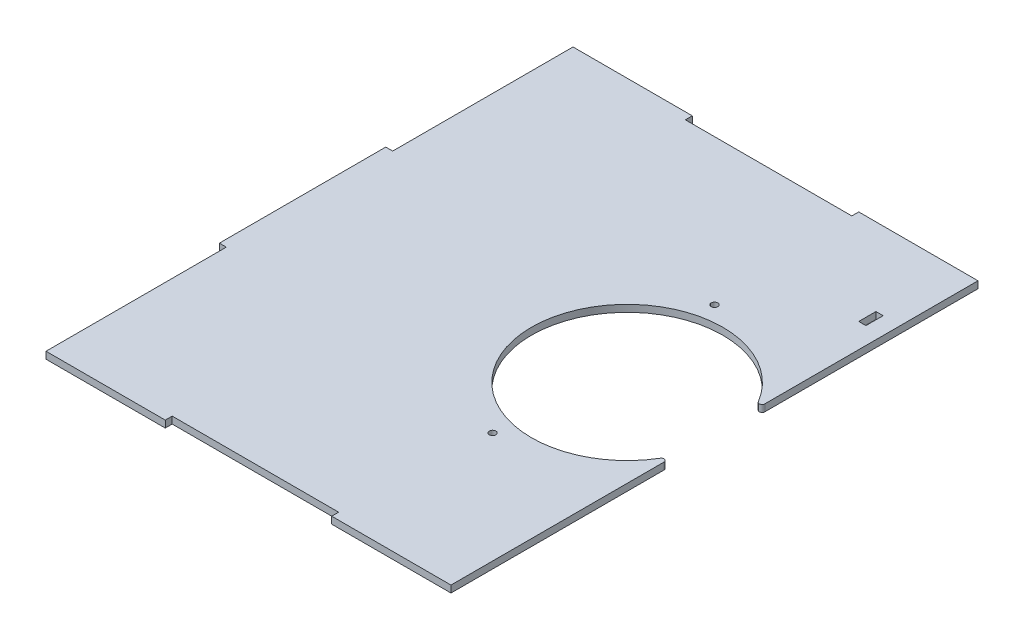
ISO-10303-21;
HEADER;
FILE_DESCRIPTION(('STEP AP214'),'2;1');
FILE_NAME('part.step','',(''),(''),'','','');
FILE_SCHEMA(('AUTOMOTIVE_DESIGN { 1 0 10303 214 1 1 1 1 }'));
ENDSEC;
DATA;
#1=APPLICATION_CONTEXT('core data for automotive mechanical design processes');
#2=APPLICATION_PROTOCOL_DEFINITION('international standard','automotive_design',2000,#1);
#3=PRODUCT_CONTEXT('',#1,'mechanical');
#4=PRODUCT('Part','Part','',(#3));
#5=PRODUCT_RELATED_PRODUCT_CATEGORY('part','',(#4));
#6=PRODUCT_DEFINITION_FORMATION('','',#4);
#7=PRODUCT_DEFINITION_CONTEXT('part definition',#1,'design');
#8=PRODUCT_DEFINITION('design','',#6,#7);
#9=PRODUCT_DEFINITION_SHAPE('','',#8);
#10=(LENGTH_UNIT() NAMED_UNIT(*) SI_UNIT(.MILLI.,.METRE.));
#11=(NAMED_UNIT(*) PLANE_ANGLE_UNIT() SI_UNIT($,.RADIAN.));
#12=(NAMED_UNIT(*) SI_UNIT($,.STERADIAN.) SOLID_ANGLE_UNIT());
#13=UNCERTAINTY_MEASURE_WITH_UNIT(LENGTH_MEASURE(1.E-05),#10,'distance_accuracy_value','');
#14=(GEOMETRIC_REPRESENTATION_CONTEXT(3) GLOBAL_UNCERTAINTY_ASSIGNED_CONTEXT((#13)) GLOBAL_UNIT_ASSIGNED_CONTEXT((#10,
#11,#12)) REPRESENTATION_CONTEXT('',''));
#15=CARTESIAN_POINT('',(0.,0.,0.));
#16=DIRECTION('',(0.,0.,1.));
#17=DIRECTION('',(1.,0.,0.));
#18=AXIS2_PLACEMENT_3D('',#15,#16,#17);
#19=CARTESIAN_POINT('',(0.,3.175,0.));
#20=DIRECTION('',(1.,0.,0.));
#21=DIRECTION('',(0.,0.,-1.));
#22=AXIS2_PLACEMENT_3D('',#19,#20,#21);
#23=PLANE('',#22);
#24=DIRECTION('',(0.,1.,0.));
#25=VECTOR('',#24,1.);
#26=CARTESIAN_POINT('',(0.,-76.2661171490984,-82.55));
#27=LINE('',#26,#25);
#28=CARTESIAN_POINT('',(0.,0.,-82.55));
#29=VERTEX_POINT('',#28);
#30=CARTESIAN_POINT('',(0.,3.175,-82.55));
#31=VERTEX_POINT('',#30);
#32=EDGE_CURVE('E248',#29,#31,#27,.T.);
#33=ORIENTED_EDGE('',*,*,#32,.F.);
#34=DIRECTION('',(0.,0.,1.));
#35=VECTOR('',#34,1.);
#36=CARTESIAN_POINT('',(0.,0.,0.));
#37=LINE('',#36,#35);
#38=CARTESIAN_POINT('',(0.,0.,0.));
#39=VERTEX_POINT('',#38);
#40=EDGE_CURVE('E326',#29,#39,#37,.T.);
#41=ORIENTED_EDGE('',*,*,#40,.T.);
#42=DIRECTION('',(0.,-1.,0.));
#43=VECTOR('',#42,1.);
#44=CARTESIAN_POINT('',(0.,3.175,0.));
#45=LINE('',#44,#43);
#46=CARTESIAN_POINT('',(0.,3.175,0.));
#47=VERTEX_POINT('',#46);
#48=EDGE_CURVE('E367',#47,#39,#45,.T.);
#49=ORIENTED_EDGE('',*,*,#48,.F.);
#50=DIRECTION('',(0.,0.,1.));
#51=VECTOR('',#50,1.);
#52=CARTESIAN_POINT('',(0.,3.175,0.));
#53=LINE('',#52,#51);
#54=EDGE_CURVE('E331',#31,#47,#53,.T.);
#55=ORIENTED_EDGE('',*,*,#54,.F.);
#56=EDGE_LOOP('',(#33,#41,#49,#55));
#57=FACE_BOUND('',#56,.T.);
#58=ADVANCED_FACE('F36',(#57),#23,.F.);
#59=CARTESIAN_POINT('',(0.,3.175,0.));
#60=DIRECTION('',(0.,0.,-1.));
#61=DIRECTION('',(-1.,0.,0.));
#62=AXIS2_PLACEMENT_3D('',#59,#60,#61);
#63=PLANE('',#62);
#64=DIRECTION('',(1.,0.,0.));
#65=VECTOR('',#64,1.);
#66=CARTESIAN_POINT('',(0.,0.,0.));
#67=LINE('',#66,#65);
#68=CARTESIAN_POINT('',(54.6100000000003,0.,0.));
#69=VERTEX_POINT('',#68);
#70=EDGE_CURVE('E348',#39,#69,#67,.T.);
#71=ORIENTED_EDGE('',*,*,#70,.T.);
#72=DIRECTION('',(0.,1.,0.));
#73=VECTOR('',#72,1.);
#74=CARTESIAN_POINT('',(54.6100000000003,0.,0.));
#75=LINE('',#74,#73);
#76=CARTESIAN_POINT('',(54.6100000000003,3.175,0.));
#77=VERTEX_POINT('',#76);
#78=EDGE_CURVE('E270',#69,#77,#75,.T.);
#79=ORIENTED_EDGE('',*,*,#78,.T.);
#80=DIRECTION('',(1.,0.,0.));
#81=VECTOR('',#80,1.);
#82=CARTESIAN_POINT('',(0.,3.175,0.));
#83=LINE('',#82,#81);
#84=EDGE_CURVE('E332',#47,#77,#83,.T.);
#85=ORIENTED_EDGE('',*,*,#84,.F.);
#86=ORIENTED_EDGE('',*,*,#48,.T.);
#87=EDGE_LOOP('',(#71,#79,#85,#86));
#88=FACE_BOUND('',#87,.T.);
#89=ADVANCED_FACE('F456',(#88),#63,.F.);
#90=CARTESIAN_POINT('',(0.,3.175,-241.3));
#91=DIRECTION('',(0.,0.,1.));
#92=DIRECTION('',(1.,0.,0.));
#93=AXIS2_PLACEMENT_3D('',#90,#91,#92);
#94=PLANE('',#93);
#95=DIRECTION('',(-1.,0.,0.));
#96=VECTOR('',#95,1.);
#97=CARTESIAN_POINT('',(0.,0.,-241.3));
#98=LINE('',#97,#96);
#99=CARTESIAN_POINT('',(185.42,0.,-241.3));
#100=VERTEX_POINT('',#99);
#101=CARTESIAN_POINT('',(130.81,0.,-241.3));
#102=VERTEX_POINT('',#101);
#103=EDGE_CURVE('E356',#100,#102,#98,.T.);
#104=ORIENTED_EDGE('',*,*,#103,.T.);
#105=DIRECTION('',(0.,1.,0.));
#106=VECTOR('',#105,1.);
#107=CARTESIAN_POINT('',(130.81,0.,-241.3));
#108=LINE('',#107,#106);
#109=CARTESIAN_POINT('',(130.81,3.175,-241.3));
#110=VERTEX_POINT('',#109);
#111=EDGE_CURVE('E296',#102,#110,#108,.T.);
#112=ORIENTED_EDGE('',*,*,#111,.T.);
#113=DIRECTION('',(-1.,0.,0.));
#114=VECTOR('',#113,1.);
#115=CARTESIAN_POINT('',(0.,3.175,-241.3));
#116=LINE('',#115,#114);
#117=CARTESIAN_POINT('',(185.42,3.175,-241.3));
#118=VERTEX_POINT('',#117);
#119=EDGE_CURVE('E340',#118,#110,#116,.T.);
#120=ORIENTED_EDGE('',*,*,#119,.F.);
#121=DIRECTION('',(0.,-1.,0.));
#122=VECTOR('',#121,1.);
#123=CARTESIAN_POINT('',(185.42,3.175,-241.3));
#124=LINE('',#123,#122);
#125=EDGE_CURVE('E361',#118,#100,#124,.T.);
#126=ORIENTED_EDGE('',*,*,#125,.T.);
#127=EDGE_LOOP('',(#104,#112,#120,#126));
#128=FACE_BOUND('',#127,.T.);
#129=ADVANCED_FACE('F415',(#128),#94,.F.);
#130=CARTESIAN_POINT('',(185.42,3.175,0.));
#131=DIRECTION('',(-1.,0.,0.));
#132=DIRECTION('',(0.,0.,1.));
#133=AXIS2_PLACEMENT_3D('',#130,#131,#132);
#134=PLANE('',#133);
#135=DIRECTION('',(0.,0.,-1.));
#136=VECTOR('',#135,1.);
#137=CARTESIAN_POINT('',(185.42,0.,0.));
#138=LINE('',#137,#136);
#139=CARTESIAN_POINT('',(185.42,0.,0.));
#140=VERTEX_POINT('',#139);
#141=CARTESIAN_POINT('',(185.42,0.,-97.5793043017771));
#142=VERTEX_POINT('',#141);
#143=EDGE_CURVE('E352',#140,#142,#138,.T.);
#144=ORIENTED_EDGE('',*,*,#143,.T.);
#145=DIRECTION('',(0.,1.,0.));
#146=VECTOR('',#145,1.);
#147=CARTESIAN_POINT('',(185.42,3.175,-97.5793043017771));
#148=LINE('',#147,#146);
#149=CARTESIAN_POINT('',(185.42,3.175,-97.5793043017771));
#150=VERTEX_POINT('',#149);
#151=EDGE_CURVE('E373',#142,#150,#148,.T.);
#152=ORIENTED_EDGE('',*,*,#151,.T.);
#153=DIRECTION('',(0.,0.,-1.));
#154=VECTOR('',#153,1.);
#155=CARTESIAN_POINT('',(185.42,3.175,0.));
#156=LINE('',#155,#154);
#157=CARTESIAN_POINT('',(185.42,3.175,0.));
#158=VERTEX_POINT('',#157);
#159=EDGE_CURVE('E336',#158,#150,#156,.T.);
#160=ORIENTED_EDGE('',*,*,#159,.F.);
#161=DIRECTION('',(0.,-1.,0.));
#162=VECTOR('',#161,1.);
#163=CARTESIAN_POINT('',(185.42,3.175,0.));
#164=LINE('',#163,#162);
#165=EDGE_CURVE('E364',#158,#140,#164,.T.);
#166=ORIENTED_EDGE('',*,*,#165,.T.);
#167=EDGE_LOOP('',(#144,#152,#160,#166));
#168=FACE_BOUND('',#167,.T.);
#169=ADVANCED_FACE('F394',(#168),#134,.F.);
#170=CARTESIAN_POINT('',(0.,0.,-241.3));
#171=VERTEX_POINT('',#170);
#172=CARTESIAN_POINT('',(0.,0.,-158.75));
#173=VERTEX_POINT('',#172);
#174=EDGE_CURVE('E344',#171,#173,#37,.T.);
#175=ORIENTED_EDGE('',*,*,#174,.T.);
#176=DIRECTION('',(0.,1.,0.));
#177=VECTOR('',#176,1.);
#178=CARTESIAN_POINT('',(0.,-76.2661171490984,-158.75));
#179=LINE('',#178,#177);
#180=CARTESIAN_POINT('',(0.,3.175,-158.75));
#181=VERTEX_POINT('',#180);
#182=EDGE_CURVE('E254',#173,#181,#179,.T.);
#183=ORIENTED_EDGE('',*,*,#182,.T.);
#184=CARTESIAN_POINT('',(0.,3.175,-241.3));
#185=VERTEX_POINT('',#184);
#186=EDGE_CURVE('E327',#185,#181,#53,.T.);
#187=ORIENTED_EDGE('',*,*,#186,.F.);
#188=DIRECTION('',(0.,-1.,0.));
#189=VECTOR('',#188,1.);
#190=CARTESIAN_POINT('',(0.,3.175,-241.3));
#191=LINE('',#190,#189);
#192=EDGE_CURVE('E343',#185,#171,#191,.T.);
#193=ORIENTED_EDGE('',*,*,#192,.T.);
#194=EDGE_LOOP('',(#175,#183,#187,#193));
#195=FACE_BOUND('',#194,.T.);
#196=ADVANCED_FACE('F436',(#195),#23,.F.);
#197=CARTESIAN_POINT('',(130.81,3.175,0.));
#198=VERTEX_POINT('',#197);
#199=EDGE_CURVE('E330',#198,#158,#83,.T.);
#200=ORIENTED_EDGE('',*,*,#199,.F.);
#201=DIRECTION('',(0.,1.,0.));
#202=VECTOR('',#201,1.);
#203=CARTESIAN_POINT('',(130.81,0.,0.));
#204=LINE('',#203,#202);
#205=CARTESIAN_POINT('',(130.81,0.,0.));
#206=VERTEX_POINT('',#205);
#207=EDGE_CURVE('E282',#206,#198,#204,.T.);
#208=ORIENTED_EDGE('',*,*,#207,.F.);
#209=EDGE_CURVE('E347',#206,#140,#67,.T.);
#210=ORIENTED_EDGE('',*,*,#209,.T.);
#211=ORIENTED_EDGE('',*,*,#165,.F.);
#212=EDGE_LOOP('',(#200,#208,#210,#211));
#213=FACE_BOUND('',#212,.T.);
#214=ADVANCED_FACE('F471',(#213),#63,.F.);
#215=CARTESIAN_POINT('',(185.42,3.175,-143.720695698223));
#216=VERTEX_POINT('',#215);
#217=EDGE_CURVE('E335',#216,#118,#156,.T.);
#218=ORIENTED_EDGE('',*,*,#217,.F.);
#219=DIRECTION('',(0.,1.,0.));
#220=VECTOR('',#219,1.);
#221=CARTESIAN_POINT('',(185.42,3.175,-143.720695698223));
#222=LINE('',#221,#220);
#223=CARTESIAN_POINT('',(185.42,0.,-143.720695698223));
#224=VERTEX_POINT('',#223);
#225=EDGE_CURVE('E11',#216,#224,#222,.F.);
#226=ORIENTED_EDGE('',*,*,#225,.T.);
#227=EDGE_CURVE('E351',#224,#100,#138,.T.);
#228=ORIENTED_EDGE('',*,*,#227,.T.);
#229=ORIENTED_EDGE('',*,*,#125,.F.);
#230=EDGE_LOOP('',(#218,#226,#228,#229));
#231=FACE_BOUND('',#230,.T.);
#232=ADVANCED_FACE('F410',(#231),#134,.F.);
#233=CARTESIAN_POINT('',(54.6100000000003,3.175,-241.3));
#234=VERTEX_POINT('',#233);
#235=EDGE_CURVE('E339',#234,#185,#116,.T.);
#236=ORIENTED_EDGE('',*,*,#235,.F.);
#237=DIRECTION('',(0.,1.,0.));
#238=VECTOR('',#237,1.);
#239=CARTESIAN_POINT('',(54.6100000000003,0.,-241.3));
#240=LINE('',#239,#238);
#241=CARTESIAN_POINT('',(54.6100000000003,0.,-241.3));
#242=VERTEX_POINT('',#241);
#243=EDGE_CURVE('E308',#242,#234,#240,.T.);
#244=ORIENTED_EDGE('',*,*,#243,.F.);
#245=EDGE_CURVE('E355',#242,#171,#98,.T.);
#246=ORIENTED_EDGE('',*,*,#245,.T.);
#247=ORIENTED_EDGE('',*,*,#192,.F.);
#248=EDGE_LOOP('',(#236,#244,#246,#247));
#249=FACE_BOUND('',#248,.T.);
#250=ADVANCED_FACE('F431',(#249),#94,.F.);
#251=CARTESIAN_POINT('',(0.,3.175,0.));
#252=DIRECTION('',(0.,-1.,0.));
#253=DIRECTION('',(0.,0.,-1.));
#254=AXIS2_PLACEMENT_3D('',#251,#252,#253);
#255=PLANE('',#254);
#256=DIRECTION('',(1.,0.,0.));
#257=VECTOR('',#256,1.);
#258=CARTESIAN_POINT('',(174.244,3.175,-197.866));
#259=LINE('',#258,#257);
#260=CARTESIAN_POINT('',(174.244,3.175,-197.866));
#261=VERTEX_POINT('',#260);
#262=CARTESIAN_POINT('',(177.546,3.175,-197.866));
#263=VERTEX_POINT('',#262);
#264=EDGE_CURVE('E224',#261,#263,#259,.T.);
#265=ORIENTED_EDGE('',*,*,#264,.F.);
#266=DIRECTION('',(0.,0.,1.));
#267=VECTOR('',#266,1.);
#268=CARTESIAN_POINT('',(174.244,3.175,-197.866));
#269=LINE('',#268,#267);
#270=CARTESIAN_POINT('',(174.244,3.175,-205.74));
#271=VERTEX_POINT('',#270);
#272=EDGE_CURVE('E51',#271,#261,#269,.T.);
#273=ORIENTED_EDGE('',*,*,#272,.F.);
#274=DIRECTION('',(-1.,0.,0.));
#275=VECTOR('',#274,1.);
#276=CARTESIAN_POINT('',(174.244,3.175,-205.74));
#277=LINE('',#276,#275);
#278=CARTESIAN_POINT('',(177.546,3.175,-205.74));
#279=VERTEX_POINT('',#278);
#280=EDGE_CURVE('E215',#279,#271,#277,.T.);
#281=ORIENTED_EDGE('',*,*,#280,.F.);
#282=DIRECTION('',(0.,0.,-1.));
#283=VECTOR('',#282,1.);
#284=CARTESIAN_POINT('',(177.546,3.175,-197.866));
#285=LINE('',#284,#283);
#286=EDGE_CURVE('E218',#263,#279,#285,.T.);
#287=ORIENTED_EDGE('',*,*,#286,.F.);
#288=EDGE_LOOP('',(#265,#273,#281,#287));
#289=FACE_BOUND('',#288,.T.);
#290=CARTESIAN_POINT('',(134.62,3.175,-69.85));
#291=DIRECTION('',(0.,1.,0.));
#292=DIRECTION('',(0.,0.,-1.));
#293=AXIS2_PLACEMENT_3D('',#290,#291,#292);
#294=CIRCLE('',#293,1.5);
#295=CARTESIAN_POINT('',(134.62,3.175,-71.35));
#296=VERTEX_POINT('',#295);
#297=EDGE_CURVE('E305',#296,#296,#294,.T.);
#298=ORIENTED_EDGE('',*,*,#297,.F.);
#299=EDGE_LOOP('',(#298));
#300=FACE_BOUND('',#299,.T.);
#301=CARTESIAN_POINT('',(134.62,3.175,-171.45));
#302=DIRECTION('',(0.,1.,0.));
#303=DIRECTION('',(0.,0.,1.));
#304=AXIS2_PLACEMENT_3D('',#301,#302,#303);
#305=CIRCLE('',#304,1.5);
#306=CARTESIAN_POINT('',(134.62,3.175,-169.95));
#307=VERTEX_POINT('',#306);
#308=EDGE_CURVE('E315',#307,#307,#305,.T.);
#309=ORIENTED_EDGE('',*,*,#308,.F.);
#310=EDGE_LOOP('',(#309));
#311=FACE_BOUND('',#310,.T.);
#312=ORIENTED_EDGE('',*,*,#84,.T.);
#313=DIRECTION('',(0.,0.,1.));
#314=VECTOR('',#313,1.);
#315=CARTESIAN_POINT('',(54.6100000000003,3.175,0.));
#316=LINE('',#315,#314);
#317=CARTESIAN_POINT('',(54.6100000000003,3.175,-3.17500000000001));
#318=VERTEX_POINT('',#317);
#319=EDGE_CURVE('E259',#318,#77,#316,.T.);
#320=ORIENTED_EDGE('',*,*,#319,.F.);
#321=DIRECTION('',(-1.,0.,0.));
#322=VECTOR('',#321,1.);
#323=CARTESIAN_POINT('',(54.6100000000003,3.175,-3.17500000000001));
#324=LINE('',#323,#322);
#325=CARTESIAN_POINT('',(130.81,3.175,-3.17500000000001));
#326=VERTEX_POINT('',#325);
#327=EDGE_CURVE('E264',#326,#318,#324,.T.);
#328=ORIENTED_EDGE('',*,*,#327,.F.);
#329=DIRECTION('',(0.,0.,-1.));
#330=VECTOR('',#329,1.);
#331=CARTESIAN_POINT('',(130.81,3.175,0.));
#332=LINE('',#331,#330);
#333=EDGE_CURVE('E272',#198,#326,#332,.T.);
#334=ORIENTED_EDGE('',*,*,#333,.F.);
#335=ORIENTED_EDGE('',*,*,#199,.T.);
#336=ORIENTED_EDGE('',*,*,#159,.T.);
#337=CARTESIAN_POINT('',(184.15,3.175,-97.5793043017771));
#338=DIRECTION('',(0.,-1.,0.));
#339=DIRECTION('',(0.,0.,-1.));
#340=AXIS2_PLACEMENT_3D('',#337,#338,#339);
#341=CIRCLE('',#340,1.27);
#342=CARTESIAN_POINT('',(183.058873239437,3.175,-98.2291830538397));
#343=VERTEX_POINT('',#342);
#344=EDGE_CURVE('E378',#150,#343,#341,.F.);
#345=ORIENTED_EDGE('',*,*,#344,.T.);
#346=CARTESIAN_POINT('',(145.415,3.175,-120.65));
#347=DIRECTION('',(0.,1.,0.));
#348=DIRECTION('',(0.,0.,1.));
#349=AXIS2_PLACEMENT_3D('',#346,#347,#348);
#350=CIRCLE('',#349,43.815);
#351=CARTESIAN_POINT('',(183.058873239437,3.175,-143.07081694616));
#352=VERTEX_POINT('',#351);
#353=EDGE_CURVE('E321',#352,#343,#350,.T.);
#354=ORIENTED_EDGE('',*,*,#353,.F.);
#355=CARTESIAN_POINT('',(184.15,3.175,-143.720695698223));
#356=DIRECTION('',(0.,-1.,0.));
#357=DIRECTION('',(0.,0.,-1.));
#358=AXIS2_PLACEMENT_3D('',#355,#356,#357);
#359=CIRCLE('',#358,1.27);
#360=EDGE_CURVE('E376',#352,#216,#359,.F.);
#361=ORIENTED_EDGE('',*,*,#360,.T.);
#362=ORIENTED_EDGE('',*,*,#217,.T.);
#363=ORIENTED_EDGE('',*,*,#119,.T.);
#364=DIRECTION('',(0.,0.,-1.));
#365=VECTOR('',#364,1.);
#366=CARTESIAN_POINT('',(130.81,3.175,-241.3));
#367=LINE('',#366,#365);
#368=CARTESIAN_POINT('',(130.81,3.175,-238.125));
#369=VERTEX_POINT('',#368);
#370=EDGE_CURVE('E279',#369,#110,#367,.T.);
#371=ORIENTED_EDGE('',*,*,#370,.F.);
#372=DIRECTION('',(1.,0.,0.));
#373=VECTOR('',#372,1.);
#374=CARTESIAN_POINT('',(54.6100000000003,3.175,-238.125));
#375=LINE('',#374,#373);
#376=CARTESIAN_POINT('',(54.6100000000003,3.175,-238.125));
#377=VERTEX_POINT('',#376);
#378=EDGE_CURVE('E290',#377,#369,#375,.T.);
#379=ORIENTED_EDGE('',*,*,#378,.F.);
#380=DIRECTION('',(0.,0.,1.));
#381=VECTOR('',#380,1.);
#382=CARTESIAN_POINT('',(54.6100000000003,3.175,-241.3));
#383=LINE('',#382,#381);
#384=EDGE_CURVE('E298',#234,#377,#383,.T.);
#385=ORIENTED_EDGE('',*,*,#384,.F.);
#386=ORIENTED_EDGE('',*,*,#235,.T.);
#387=ORIENTED_EDGE('',*,*,#186,.T.);
#388=DIRECTION('',(-1.,0.,0.));
#389=VECTOR('',#388,1.);
#390=CARTESIAN_POINT('',(-3.17500000000005,3.175,-158.75));
#391=LINE('',#390,#389);
#392=CARTESIAN_POINT('',(-3.17500000000005,3.175,-158.75));
#393=VERTEX_POINT('',#392);
#394=EDGE_CURVE('E230',#181,#393,#391,.T.);
#395=ORIENTED_EDGE('',*,*,#394,.T.);
#396=DIRECTION('',(0.,0.,1.));
#397=VECTOR('',#396,1.);
#398=CARTESIAN_POINT('',(-3.17500000000005,3.175,-158.75));
#399=LINE('',#398,#397);
#400=CARTESIAN_POINT('',(-3.17500000000004,3.175,-82.55));
#401=VERTEX_POINT('',#400);
#402=EDGE_CURVE('E238',#393,#401,#399,.T.);
#403=ORIENTED_EDGE('',*,*,#402,.T.);
#404=DIRECTION('',(1.,0.,0.));
#405=VECTOR('',#404,1.);
#406=CARTESIAN_POINT('',(-3.17500000000004,3.175,-82.55));
#407=LINE('',#406,#405);
#408=EDGE_CURVE('E234',#401,#31,#407,.T.);
#409=ORIENTED_EDGE('',*,*,#408,.T.);
#410=ORIENTED_EDGE('',*,*,#54,.T.);
#411=EDGE_LOOP('',(#312,#320,#328,#334,#335,#336,#345,#354,#361,#362,#363,#371,#379,#385,#386,
#387,#395,#403,#409,#410));
#412=FACE_BOUND('',#411,.T.);
#413=ADVANCED_FACE('F400',(#289,#300,#311,#412),#255,.F.);
#414=CARTESIAN_POINT('',(0.,0.,0.));
#415=DIRECTION('',(0.,-1.,0.));
#416=DIRECTION('',(0.,0.,-1.));
#417=AXIS2_PLACEMENT_3D('',#414,#415,#416);
#418=PLANE('',#417);
#419=DIRECTION('',(0.,0.,1.));
#420=VECTOR('',#419,1.);
#421=CARTESIAN_POINT('',(174.244,0.,-197.866));
#422=LINE('',#421,#420);
#423=CARTESIAN_POINT('',(174.244,0.,-205.74));
#424=VERTEX_POINT('',#423);
#425=CARTESIAN_POINT('',(174.244,0.,-197.866));
#426=VERTEX_POINT('',#425);
#427=EDGE_CURVE('E199',#424,#426,#422,.T.);
#428=ORIENTED_EDGE('',*,*,#427,.T.);
#429=DIRECTION('',(1.,0.,0.));
#430=VECTOR('',#429,1.);
#431=CARTESIAN_POINT('',(174.244,0.,-197.866));
#432=LINE('',#431,#430);
#433=CARTESIAN_POINT('',(177.546,0.,-197.866));
#434=VERTEX_POINT('',#433);
#435=EDGE_CURVE('E208',#426,#434,#432,.T.);
#436=ORIENTED_EDGE('',*,*,#435,.T.);
#437=DIRECTION('',(0.,0.,-1.));
#438=VECTOR('',#437,1.);
#439=CARTESIAN_POINT('',(177.546,0.,-197.866));
#440=LINE('',#439,#438);
#441=CARTESIAN_POINT('',(177.546,0.,-205.74));
#442=VERTEX_POINT('',#441);
#443=EDGE_CURVE('E59',#434,#442,#440,.T.);
#444=ORIENTED_EDGE('',*,*,#443,.T.);
#445=DIRECTION('',(-1.,0.,0.));
#446=VECTOR('',#445,1.);
#447=CARTESIAN_POINT('',(174.244,0.,-205.74));
#448=LINE('',#447,#446);
#449=EDGE_CURVE('E205',#442,#424,#448,.T.);
#450=ORIENTED_EDGE('',*,*,#449,.T.);
#451=EDGE_LOOP('',(#428,#436,#444,#450));
#452=FACE_BOUND('',#451,.T.);
#453=DIRECTION('',(0.,0.,1.));
#454=VECTOR('',#453,1.);
#455=CARTESIAN_POINT('',(54.6100000000003,0.,0.));
#456=LINE('',#455,#454);
#457=CARTESIAN_POINT('',(54.6100000000003,0.,-3.17500000000001));
#458=VERTEX_POINT('',#457);
#459=EDGE_CURVE('E260',#458,#69,#456,.T.);
#460=ORIENTED_EDGE('',*,*,#459,.T.);
#461=ORIENTED_EDGE('',*,*,#70,.F.);
#462=ORIENTED_EDGE('',*,*,#40,.F.);
#463=DIRECTION('',(1.,0.,0.));
#464=VECTOR('',#463,1.);
#465=CARTESIAN_POINT('',(-3.17500000000004,0.,-82.55));
#466=LINE('',#465,#464);
#467=CARTESIAN_POINT('',(-3.17500000000004,0.,-82.55));
#468=VERTEX_POINT('',#467);
#469=EDGE_CURVE('E246',#468,#29,#466,.T.);
#470=ORIENTED_EDGE('',*,*,#469,.F.);
#471=DIRECTION('',(0.,0.,1.));
#472=VECTOR('',#471,1.);
#473=CARTESIAN_POINT('',(-3.17500000000005,0.,-158.75));
#474=LINE('',#473,#472);
#475=CARTESIAN_POINT('',(-3.17500000000005,0.,-158.75));
#476=VERTEX_POINT('',#475);
#477=EDGE_CURVE('E250',#476,#468,#474,.T.);
#478=ORIENTED_EDGE('',*,*,#477,.F.);
#479=DIRECTION('',(-1.,0.,0.));
#480=VECTOR('',#479,1.);
#481=CARTESIAN_POINT('',(-3.17500000000005,0.,-158.75));
#482=LINE('',#481,#480);
#483=EDGE_CURVE('E237',#173,#476,#482,.T.);
#484=ORIENTED_EDGE('',*,*,#483,.F.);
#485=ORIENTED_EDGE('',*,*,#174,.F.);
#486=ORIENTED_EDGE('',*,*,#245,.F.);
#487=DIRECTION('',(0.,0.,1.));
#488=VECTOR('',#487,1.);
#489=CARTESIAN_POINT('',(54.6100000000003,0.,-241.3));
#490=LINE('',#489,#488);
#491=CARTESIAN_POINT('',(54.6100000000003,0.,-238.125));
#492=VERTEX_POINT('',#491);
#493=EDGE_CURVE('E289',#242,#492,#490,.T.);
#494=ORIENTED_EDGE('',*,*,#493,.T.);
#495=DIRECTION('',(1.,0.,0.));
#496=VECTOR('',#495,1.);
#497=CARTESIAN_POINT('',(54.6100000000003,0.,-238.125));
#498=LINE('',#497,#496);
#499=CARTESIAN_POINT('',(130.81,0.,-238.125));
#500=VERTEX_POINT('',#499);
#501=EDGE_CURVE('E293',#492,#500,#498,.T.);
#502=ORIENTED_EDGE('',*,*,#501,.T.);
#503=DIRECTION('',(0.,0.,-1.));
#504=VECTOR('',#503,1.);
#505=CARTESIAN_POINT('',(130.81,0.,-241.3));
#506=LINE('',#505,#504);
#507=EDGE_CURVE('E286',#500,#102,#506,.T.);
#508=ORIENTED_EDGE('',*,*,#507,.T.);
#509=ORIENTED_EDGE('',*,*,#103,.F.);
#510=ORIENTED_EDGE('',*,*,#227,.F.);
#511=CARTESIAN_POINT('',(184.15,0.,-143.720695698223));
#512=DIRECTION('',(0.,-1.,0.));
#513=DIRECTION('',(0.,0.,-1.));
#514=AXIS2_PLACEMENT_3D('',#511,#512,#513);
#515=CIRCLE('',#514,1.27);
#516=CARTESIAN_POINT('',(183.058873239437,0.,-143.07081694616));
#517=VERTEX_POINT('',#516);
#518=EDGE_CURVE('E384',#224,#517,#515,.T.);
#519=ORIENTED_EDGE('',*,*,#518,.T.);
#520=CARTESIAN_POINT('',(145.415,0.,-120.65));
#521=DIRECTION('',(0.,-1.,0.));
#522=DIRECTION('',(0.,0.,-1.));
#523=AXIS2_PLACEMENT_3D('',#520,#521,#522);
#524=CIRCLE('',#523,43.815);
#525=CARTESIAN_POINT('',(183.058873239437,0.,-98.2291830538397));
#526=VERTEX_POINT('',#525);
#527=EDGE_CURVE('E370',#526,#517,#524,.T.);
#528=ORIENTED_EDGE('',*,*,#527,.F.);
#529=CARTESIAN_POINT('',(184.15,0.,-97.5793043017771));
#530=DIRECTION('',(0.,-1.,0.));
#531=DIRECTION('',(0.,0.,-1.));
#532=AXIS2_PLACEMENT_3D('',#529,#530,#531);
#533=CIRCLE('',#532,1.27);
#534=EDGE_CURVE('E44',#526,#142,#533,.T.);
#535=ORIENTED_EDGE('',*,*,#534,.T.);
#536=ORIENTED_EDGE('',*,*,#143,.F.);
#537=ORIENTED_EDGE('',*,*,#209,.F.);
#538=DIRECTION('',(0.,0.,-1.));
#539=VECTOR('',#538,1.);
#540=CARTESIAN_POINT('',(130.81,0.,0.));
#541=LINE('',#540,#539);
#542=CARTESIAN_POINT('',(130.81,0.,-3.17500000000001));
#543=VERTEX_POINT('',#542);
#544=EDGE_CURVE('E263',#206,#543,#541,.T.);
#545=ORIENTED_EDGE('',*,*,#544,.T.);
#546=DIRECTION('',(-1.,0.,0.));
#547=VECTOR('',#546,1.);
#548=CARTESIAN_POINT('',(54.6100000000003,0.,-3.17500000000001));
#549=LINE('',#548,#547);
#550=EDGE_CURVE('E267',#543,#458,#549,.T.);
#551=ORIENTED_EDGE('',*,*,#550,.T.);
#552=EDGE_LOOP('',(#460,#461,#462,#470,#478,#484,#485,#486,#494,#502,#508,#509,#510,#519,#528,
#535,#536,#537,#545,#551));
#553=FACE_BOUND('',#552,.T.);
#554=CARTESIAN_POINT('',(134.62,0.,-69.85));
#555=DIRECTION('',(0.,1.,0.));
#556=DIRECTION('',(0.,0.,-1.));
#557=AXIS2_PLACEMENT_3D('',#554,#555,#556);
#558=CIRCLE('',#557,1.5);
#559=CARTESIAN_POINT('',(134.62,0.,-71.35));
#560=VERTEX_POINT('',#559);
#561=EDGE_CURVE('E312',#560,#560,#558,.T.);
#562=ORIENTED_EDGE('',*,*,#561,.T.);
#563=EDGE_LOOP('',(#562));
#564=FACE_BOUND('',#563,.T.);
#565=CARTESIAN_POINT('',(134.62,0.,-171.45));
#566=DIRECTION('',(0.,1.,0.));
#567=DIRECTION('',(0.,0.,1.));
#568=AXIS2_PLACEMENT_3D('',#565,#566,#567);
#569=CIRCLE('',#568,1.5);
#570=CARTESIAN_POINT('',(134.62,0.,-169.95));
#571=VERTEX_POINT('',#570);
#572=EDGE_CURVE('E318',#571,#571,#569,.T.);
#573=ORIENTED_EDGE('',*,*,#572,.T.);
#574=EDGE_LOOP('',(#573));
#575=FACE_BOUND('',#574,.T.);
#576=ADVANCED_FACE('F212',(#452,#553,#564,#575),#418,.T.);
#577=CARTESIAN_POINT('',(145.415,0.,-120.65));
#578=DIRECTION('',(0.,1.,0.));
#579=DIRECTION('',(0.,0.,1.));
#580=AXIS2_PLACEMENT_3D('',#577,#578,#579);
#581=CYLINDRICAL_SURFACE('',#580,43.815);
#582=ORIENTED_EDGE('',*,*,#353,.T.);
#583=DIRECTION('',(0.,1.,0.));
#584=VECTOR('',#583,1.);
#585=CARTESIAN_POINT('',(183.058873239437,0.,-98.2291830538397));
#586=LINE('',#585,#584);
#587=EDGE_CURVE('E382',#343,#526,#586,.F.);
#588=ORIENTED_EDGE('',*,*,#587,.T.);
#589=ORIENTED_EDGE('',*,*,#527,.T.);
#590=DIRECTION('',(0.,1.,0.));
#591=VECTOR('',#590,1.);
#592=CARTESIAN_POINT('',(183.058873239437,0.,-143.07081694616));
#593=LINE('',#592,#591);
#594=EDGE_CURVE('E380',#517,#352,#593,.T.);
#595=ORIENTED_EDGE('',*,*,#594,.T.);
#596=EDGE_LOOP('',(#582,#588,#589,#595));
#597=FACE_BOUND('',#596,.T.);
#598=ADVANCED_FACE('F403',(#597),#581,.F.);
#599=CARTESIAN_POINT('',(134.62,0.,-171.45));
#600=DIRECTION('',(0.,1.,0.));
#601=DIRECTION('',(0.,0.,1.));
#602=AXIS2_PLACEMENT_3D('',#599,#600,#601);
#603=CYLINDRICAL_SURFACE('',#602,1.5);
#604=ORIENTED_EDGE('',*,*,#572,.F.);
#605=EDGE_LOOP('',(#604));
#606=FACE_BOUND('',#605,.T.);
#607=ORIENTED_EDGE('',*,*,#308,.T.);
#608=EDGE_LOOP('',(#607));
#609=FACE_BOUND('',#608,.T.);
#610=ADVANCED_FACE('F490',(#606,#609),#603,.F.);
#611=CARTESIAN_POINT('',(134.62,0.,-69.85));
#612=DIRECTION('',(0.,1.,0.));
#613=DIRECTION('',(0.,0.,1.));
#614=AXIS2_PLACEMENT_3D('',#611,#612,#613);
#615=CYLINDRICAL_SURFACE('',#614,1.5);
#616=ORIENTED_EDGE('',*,*,#561,.F.);
#617=EDGE_LOOP('',(#616));
#618=FACE_BOUND('',#617,.T.);
#619=ORIENTED_EDGE('',*,*,#297,.T.);
#620=EDGE_LOOP('',(#619));
#621=FACE_BOUND('',#620,.T.);
#622=ADVANCED_FACE('F485',(#618,#621),#615,.F.);
#623=CARTESIAN_POINT('',(184.15,0.,-97.5793043017771));
#624=DIRECTION('',(0.,1.,0.));
#625=DIRECTION('',(0.,0.,1.));
#626=AXIS2_PLACEMENT_3D('',#623,#624,#625);
#627=CYLINDRICAL_SURFACE('',#626,1.27);
#628=ORIENTED_EDGE('',*,*,#534,.F.);
#629=ORIENTED_EDGE('',*,*,#587,.F.);
#630=ORIENTED_EDGE('',*,*,#344,.F.);
#631=ORIENTED_EDGE('',*,*,#151,.F.);
#632=EDGE_LOOP('',(#628,#629,#630,#631));
#633=FACE_BOUND('',#632,.T.);
#634=ADVANCED_FACE('F397',(#633),#627,.T.);
#635=CARTESIAN_POINT('',(184.15,0.,-143.720695698223));
#636=DIRECTION('',(0.,1.,0.));
#637=DIRECTION('',(0.,0.,1.));
#638=AXIS2_PLACEMENT_3D('',#635,#636,#637);
#639=CYLINDRICAL_SURFACE('',#638,1.27);
#640=ORIENTED_EDGE('',*,*,#360,.F.);
#641=ORIENTED_EDGE('',*,*,#594,.F.);
#642=ORIENTED_EDGE('',*,*,#518,.F.);
#643=ORIENTED_EDGE('',*,*,#225,.F.);
#644=EDGE_LOOP('',(#640,#641,#642,#643));
#645=FACE_BOUND('',#644,.T.);
#646=ADVANCED_FACE('F38',(#645),#639,.T.);
#647=CARTESIAN_POINT('',(130.81,0.,-241.3));
#648=DIRECTION('',(1.,0.,0.));
#649=DIRECTION('',(0.,0.,-1.));
#650=AXIS2_PLACEMENT_3D('',#647,#648,#649);
#651=PLANE('',#650);
#652=ORIENTED_EDGE('',*,*,#370,.T.);
#653=ORIENTED_EDGE('',*,*,#111,.F.);
#654=ORIENTED_EDGE('',*,*,#507,.F.);
#655=DIRECTION('',(0.,1.,0.));
#656=VECTOR('',#655,1.);
#657=CARTESIAN_POINT('',(130.81,0.,-238.125));
#658=LINE('',#657,#656);
#659=EDGE_CURVE('E303',#500,#369,#658,.T.);
#660=ORIENTED_EDGE('',*,*,#659,.T.);
#661=EDGE_LOOP('',(#652,#653,#654,#660));
#662=FACE_BOUND('',#661,.T.);
#663=ADVANCED_FACE('F420',(#662),#651,.F.);
#664=CARTESIAN_POINT('',(54.6100000000003,0.,-238.125));
#665=DIRECTION('',(0.,0.,1.));
#666=DIRECTION('',(1.,0.,0.));
#667=AXIS2_PLACEMENT_3D('',#664,#665,#666);
#668=PLANE('',#667);
#669=ORIENTED_EDGE('',*,*,#378,.T.);
#670=ORIENTED_EDGE('',*,*,#659,.F.);
#671=ORIENTED_EDGE('',*,*,#501,.F.);
#672=DIRECTION('',(0.,1.,0.));
#673=VECTOR('',#672,1.);
#674=CARTESIAN_POINT('',(54.6100000000003,0.,-238.125));
#675=LINE('',#674,#673);
#676=EDGE_CURVE('E306',#492,#377,#675,.T.);
#677=ORIENTED_EDGE('',*,*,#676,.T.);
#678=EDGE_LOOP('',(#669,#670,#671,#677));
#679=FACE_BOUND('',#678,.T.);
#680=ADVANCED_FACE('F423',(#679),#668,.F.);
#681=CARTESIAN_POINT('',(54.6100000000003,0.,-241.3));
#682=DIRECTION('',(-1.,0.,0.));
#683=DIRECTION('',(0.,0.,1.));
#684=AXIS2_PLACEMENT_3D('',#681,#682,#683);
#685=PLANE('',#684);
#686=ORIENTED_EDGE('',*,*,#384,.T.);
#687=ORIENTED_EDGE('',*,*,#676,.F.);
#688=ORIENTED_EDGE('',*,*,#493,.F.);
#689=ORIENTED_EDGE('',*,*,#243,.T.);
#690=EDGE_LOOP('',(#686,#687,#688,#689));
#691=FACE_BOUND('',#690,.T.);
#692=ADVANCED_FACE('F426',(#691),#685,.F.);
#693=CARTESIAN_POINT('',(54.6100000000003,0.,0.));
#694=DIRECTION('',(-1.,0.,0.));
#695=DIRECTION('',(0.,0.,1.));
#696=AXIS2_PLACEMENT_3D('',#693,#694,#695);
#697=PLANE('',#696);
#698=ORIENTED_EDGE('',*,*,#319,.T.);
#699=ORIENTED_EDGE('',*,*,#78,.F.);
#700=ORIENTED_EDGE('',*,*,#459,.F.);
#701=DIRECTION('',(0.,1.,0.));
#702=VECTOR('',#701,1.);
#703=CARTESIAN_POINT('',(54.6100000000003,0.,-3.17500000000001));
#704=LINE('',#703,#702);
#705=EDGE_CURVE('E277',#458,#318,#704,.T.);
#706=ORIENTED_EDGE('',*,*,#705,.T.);
#707=EDGE_LOOP('',(#698,#699,#700,#706));
#708=FACE_BOUND('',#707,.T.);
#709=ADVANCED_FACE('F461',(#708),#697,.F.);
#710=CARTESIAN_POINT('',(54.6100000000003,0.,-3.17500000000001));
#711=DIRECTION('',(0.,0.,-1.));
#712=DIRECTION('',(-1.,0.,0.));
#713=AXIS2_PLACEMENT_3D('',#710,#711,#712);
#714=PLANE('',#713);
#715=ORIENTED_EDGE('',*,*,#327,.T.);
#716=ORIENTED_EDGE('',*,*,#705,.F.);
#717=ORIENTED_EDGE('',*,*,#550,.F.);
#718=DIRECTION('',(0.,1.,0.));
#719=VECTOR('',#718,1.);
#720=CARTESIAN_POINT('',(130.81,0.,-3.17500000000001));
#721=LINE('',#720,#719);
#722=EDGE_CURVE('E280',#543,#326,#721,.T.);
#723=ORIENTED_EDGE('',*,*,#722,.T.);
#724=EDGE_LOOP('',(#715,#716,#717,#723));
#725=FACE_BOUND('',#724,.T.);
#726=ADVANCED_FACE('F464',(#725),#714,.F.);
#727=CARTESIAN_POINT('',(130.81,0.,0.));
#728=DIRECTION('',(1.,0.,0.));
#729=DIRECTION('',(0.,0.,-1.));
#730=AXIS2_PLACEMENT_3D('',#727,#728,#729);
#731=PLANE('',#730);
#732=ORIENTED_EDGE('',*,*,#333,.T.);
#733=ORIENTED_EDGE('',*,*,#722,.F.);
#734=ORIENTED_EDGE('',*,*,#544,.F.);
#735=ORIENTED_EDGE('',*,*,#207,.T.);
#736=EDGE_LOOP('',(#732,#733,#734,#735));
#737=FACE_BOUND('',#736,.T.);
#738=ADVANCED_FACE('F467',(#737),#731,.F.);
#739=CARTESIAN_POINT('',(-3.17500000000005,-76.2661171490984,-158.75));
#740=DIRECTION('',(0.,0.,-1.));
#741=DIRECTION('',(-1.,0.,0.));
#742=AXIS2_PLACEMENT_3D('',#739,#740,#741);
#743=PLANE('',#742);
#744=ORIENTED_EDGE('',*,*,#182,.F.);
#745=ORIENTED_EDGE('',*,*,#483,.T.);
#746=DIRECTION('',(0.,1.,0.));
#747=VECTOR('',#746,1.);
#748=CARTESIAN_POINT('',(-3.17500000000005,-76.2661171490984,-158.75));
#749=LINE('',#748,#747);
#750=EDGE_CURVE('E245',#476,#393,#749,.T.);
#751=ORIENTED_EDGE('',*,*,#750,.T.);
#752=ORIENTED_EDGE('',*,*,#394,.F.);
#753=EDGE_LOOP('',(#744,#745,#751,#752));
#754=FACE_BOUND('',#753,.T.);
#755=ADVANCED_FACE('F441',(#754),#743,.T.);
#756=CARTESIAN_POINT('',(-3.17500000000005,-76.2661171490984,-158.75));
#757=DIRECTION('',(-1.,0.,0.));
#758=DIRECTION('',(0.,0.,1.));
#759=AXIS2_PLACEMENT_3D('',#756,#757,#758);
#760=PLANE('',#759);
#761=ORIENTED_EDGE('',*,*,#750,.F.);
#762=ORIENTED_EDGE('',*,*,#477,.T.);
#763=DIRECTION('',(0.,1.,0.));
#764=VECTOR('',#763,1.);
#765=CARTESIAN_POINT('',(-3.17500000000004,-76.2661171490984,-82.55));
#766=LINE('',#765,#764);
#767=EDGE_CURVE('E249',#468,#401,#766,.T.);
#768=ORIENTED_EDGE('',*,*,#767,.T.);
#769=ORIENTED_EDGE('',*,*,#402,.F.);
#770=EDGE_LOOP('',(#761,#762,#768,#769));
#771=FACE_BOUND('',#770,.T.);
#772=ADVANCED_FACE('F444',(#771),#760,.T.);
#773=CARTESIAN_POINT('',(-3.17500000000004,-76.2661171490984,-82.55));
#774=DIRECTION('',(0.,0.,1.));
#775=DIRECTION('',(1.,0.,0.));
#776=AXIS2_PLACEMENT_3D('',#773,#774,#775);
#777=PLANE('',#776);
#778=ORIENTED_EDGE('',*,*,#767,.F.);
#779=ORIENTED_EDGE('',*,*,#469,.T.);
#780=ORIENTED_EDGE('',*,*,#32,.T.);
#781=ORIENTED_EDGE('',*,*,#408,.F.);
#782=EDGE_LOOP('',(#778,#779,#780,#781));
#783=FACE_BOUND('',#782,.T.);
#784=ADVANCED_FACE('F447',(#783),#777,.T.);
#785=CARTESIAN_POINT('',(174.244,0.,-197.866));
#786=DIRECTION('',(-1.,0.,0.));
#787=DIRECTION('',(0.,0.,1.));
#788=AXIS2_PLACEMENT_3D('',#785,#786,#787);
#789=PLANE('',#788);
#790=ORIENTED_EDGE('',*,*,#272,.T.);
#791=DIRECTION('',(0.,1.,0.));
#792=VECTOR('',#791,1.);
#793=CARTESIAN_POINT('',(174.244,0.,-197.866));
#794=LINE('',#793,#792);
#795=EDGE_CURVE('E195',#426,#261,#794,.T.);
#796=ORIENTED_EDGE('',*,*,#795,.F.);
#797=ORIENTED_EDGE('',*,*,#427,.F.);
#798=DIRECTION('',(0.,1.,0.));
#799=VECTOR('',#798,1.);
#800=CARTESIAN_POINT('',(174.244,0.,-205.74));
#801=LINE('',#800,#799);
#802=EDGE_CURVE('E228',#424,#271,#801,.T.);
#803=ORIENTED_EDGE('',*,*,#802,.T.);
#804=EDGE_LOOP('',(#790,#796,#797,#803));
#805=FACE_BOUND('',#804,.T.);
#806=ADVANCED_FACE('F197',(#805),#789,.F.);
#807=CARTESIAN_POINT('',(174.244,0.,-205.74));
#808=DIRECTION('',(0.,0.,-1.));
#809=DIRECTION('',(-1.,0.,0.));
#810=AXIS2_PLACEMENT_3D('',#807,#808,#809);
#811=PLANE('',#810);
#812=ORIENTED_EDGE('',*,*,#280,.T.);
#813=ORIENTED_EDGE('',*,*,#802,.F.);
#814=ORIENTED_EDGE('',*,*,#449,.F.);
#815=DIRECTION('',(0.,1.,0.));
#816=VECTOR('',#815,1.);
#817=CARTESIAN_POINT('',(177.546,0.,-205.74));
#818=LINE('',#817,#816);
#819=EDGE_CURVE('E231',#442,#279,#818,.T.);
#820=ORIENTED_EDGE('',*,*,#819,.T.);
#821=EDGE_LOOP('',(#812,#813,#814,#820));
#822=FACE_BOUND('',#821,.T.);
#823=ADVANCED_FACE('F577',(#822),#811,.F.);
#824=CARTESIAN_POINT('',(177.546,0.,-197.866));
#825=DIRECTION('',(1.,0.,0.));
#826=DIRECTION('',(0.,0.,-1.));
#827=AXIS2_PLACEMENT_3D('',#824,#825,#826);
#828=PLANE('',#827);
#829=ORIENTED_EDGE('',*,*,#286,.T.);
#830=ORIENTED_EDGE('',*,*,#819,.F.);
#831=ORIENTED_EDGE('',*,*,#443,.F.);
#832=DIRECTION('',(0.,1.,0.));
#833=VECTOR('',#832,1.);
#834=CARTESIAN_POINT('',(177.546,0.,-197.866));
#835=LINE('',#834,#833);
#836=EDGE_CURVE('E204',#434,#263,#835,.T.);
#837=ORIENTED_EDGE('',*,*,#836,.T.);
#838=EDGE_LOOP('',(#829,#830,#831,#837));
#839=FACE_BOUND('',#838,.T.);
#840=ADVANCED_FACE('F586',(#839),#828,.F.);
#841=CARTESIAN_POINT('',(174.244,0.,-197.866));
#842=DIRECTION('',(0.,0.,1.));
#843=DIRECTION('',(1.,0.,0.));
#844=AXIS2_PLACEMENT_3D('',#841,#842,#843);
#845=PLANE('',#844);
#846=ORIENTED_EDGE('',*,*,#264,.T.);
#847=ORIENTED_EDGE('',*,*,#836,.F.);
#848=ORIENTED_EDGE('',*,*,#435,.F.);
#849=ORIENTED_EDGE('',*,*,#795,.T.);
#850=EDGE_LOOP('',(#846,#847,#848,#849));
#851=FACE_BOUND('',#850,.T.);
#852=ADVANCED_FACE('F209',(#851),#845,.F.);
#853=CLOSED_SHELL('',(#58,#89,#129,#169,#196,#214,#232,#250,#413,#576,#598,#610,#622,#634,#646,
#663,#680,#692,#709,#726,#738,#755,#772,#784,#806,#823,#840,#852));
#854=MANIFOLD_SOLID_BREP('B2',#853);
#855=ADVANCED_BREP_SHAPE_REPRESENTATION('',(#18,#854),#14);
#856=SHAPE_DEFINITION_REPRESENTATION(#9,#855);
ENDSEC;
END-ISO-10303-21;
